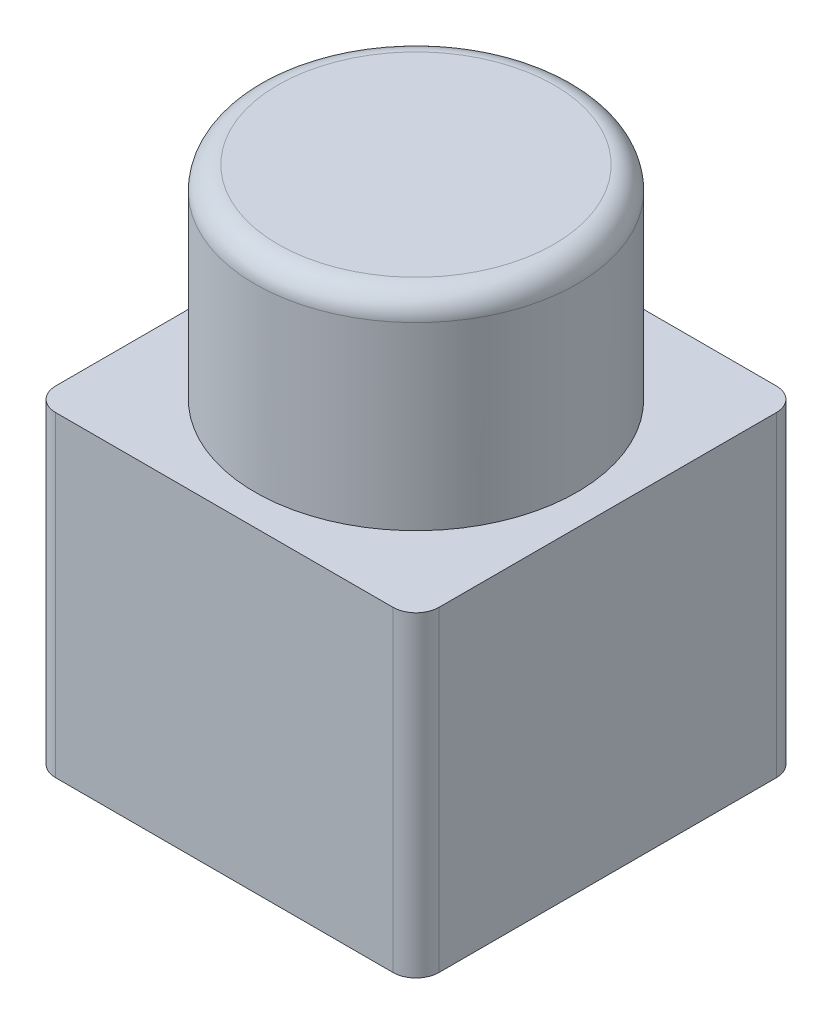
ISO-10303-21;
HEADER;
FILE_DESCRIPTION(('STEP AP214'),'2;1');
FILE_NAME('part.step','',(''),(''),'','','');
FILE_SCHEMA(('AUTOMOTIVE_DESIGN { 1 0 10303 214 1 1 1 1 }'));
ENDSEC;
DATA;
#1=APPLICATION_CONTEXT('core data for automotive mechanical design processes');
#2=APPLICATION_PROTOCOL_DEFINITION('international standard','automotive_design',2000,#1);
#3=PRODUCT_CONTEXT('',#1,'mechanical');
#4=PRODUCT('Part','Part','',(#3));
#5=PRODUCT_RELATED_PRODUCT_CATEGORY('part','',(#4));
#6=PRODUCT_DEFINITION_FORMATION('','',#4);
#7=PRODUCT_DEFINITION_CONTEXT('part definition',#1,'design');
#8=PRODUCT_DEFINITION('design','',#6,#7);
#9=PRODUCT_DEFINITION_SHAPE('','',#8);
#10=(LENGTH_UNIT() NAMED_UNIT(*) SI_UNIT(.MILLI.,.METRE.));
#11=(NAMED_UNIT(*) PLANE_ANGLE_UNIT() SI_UNIT($,.RADIAN.));
#12=(NAMED_UNIT(*) SI_UNIT($,.STERADIAN.) SOLID_ANGLE_UNIT());
#13=UNCERTAINTY_MEASURE_WITH_UNIT(LENGTH_MEASURE(1.E-05),#10,'distance_accuracy_value','');
#14=(GEOMETRIC_REPRESENTATION_CONTEXT(3) GLOBAL_UNCERTAINTY_ASSIGNED_CONTEXT((#13)) GLOBAL_UNIT_ASSIGNED_CONTEXT((#10,
#11,#12)) REPRESENTATION_CONTEXT('',''));
#15=CARTESIAN_POINT('',(0.,0.,0.));
#16=DIRECTION('',(0.,0.,1.));
#17=DIRECTION('',(1.,0.,0.));
#18=AXIS2_PLACEMENT_3D('',#15,#16,#17);
#19=CARTESIAN_POINT('',(0.,41.25,0.));
#20=DIRECTION('',(-1.,0.,0.));
#21=DIRECTION('',(0.,0.,1.));
#22=AXIS2_PLACEMENT_3D('',#19,#20,#21);
#23=PLANE('',#22);
#24=DIRECTION('',(0.,0.,-1.));
#25=VECTOR('',#24,1.);
#26=CARTESIAN_POINT('',(0.,41.25,0.));
#27=LINE('',#26,#25);
#28=CARTESIAN_POINT('',(0.,41.25,-3.));
#29=VERTEX_POINT('',#28);
#30=CARTESIAN_POINT('',(0.,41.25,-47.));
#31=VERTEX_POINT('',#30);
#32=EDGE_CURVE('E158',#29,#31,#27,.T.);
#33=ORIENTED_EDGE('',*,*,#32,.T.);
#34=DIRECTION('',(0.,-1.,0.));
#35=VECTOR('',#34,1.);
#36=CARTESIAN_POINT('',(0.,41.25,-47.));
#37=LINE('',#36,#35);
#38=CARTESIAN_POINT('',(0.,0.,-47.));
#39=VERTEX_POINT('',#38);
#40=EDGE_CURVE('E149',#31,#39,#37,.T.);
#41=ORIENTED_EDGE('',*,*,#40,.T.);
#42=DIRECTION('',(0.,0.,-1.));
#43=VECTOR('',#42,1.);
#44=CARTESIAN_POINT('',(0.,0.,0.));
#45=LINE('',#44,#43);
#46=CARTESIAN_POINT('',(0.,0.,-3.));
#47=VERTEX_POINT('',#46);
#48=EDGE_CURVE('E103',#47,#39,#45,.T.);
#49=ORIENTED_EDGE('',*,*,#48,.F.);
#50=DIRECTION('',(0.,-1.,0.));
#51=VECTOR('',#50,1.);
#52=CARTESIAN_POINT('',(0.,41.25,-3.));
#53=LINE('',#52,#51);
#54=EDGE_CURVE('E147',#47,#29,#53,.F.);
#55=ORIENTED_EDGE('',*,*,#54,.T.);
#56=EDGE_LOOP('',(#33,#41,#49,#55));
#57=FACE_BOUND('',#56,.T.);
#58=ADVANCED_FACE('F33',(#57),#23,.T.);
#59=CARTESIAN_POINT('',(0.,41.25,0.));
#60=DIRECTION('',(0.,0.,-1.));
#61=DIRECTION('',(-1.,0.,0.));
#62=AXIS2_PLACEMENT_3D('',#59,#60,#61);
#63=PLANE('',#62);
#64=DIRECTION('',(1.,0.,0.));
#65=VECTOR('',#64,1.);
#66=CARTESIAN_POINT('',(0.,0.,0.));
#67=LINE('',#66,#65);
#68=CARTESIAN_POINT('',(3.,0.,0.));
#69=VERTEX_POINT('',#68);
#70=CARTESIAN_POINT('',(47.,0.,0.));
#71=VERTEX_POINT('',#70);
#72=EDGE_CURVE('E154',#69,#71,#67,.T.);
#73=ORIENTED_EDGE('',*,*,#72,.T.);
#74=DIRECTION('',(0.,-1.,0.));
#75=VECTOR('',#74,1.);
#76=CARTESIAN_POINT('',(47.,41.25,0.));
#77=LINE('',#76,#75);
#78=CARTESIAN_POINT('',(47.,41.25,0.));
#79=VERTEX_POINT('',#78);
#80=EDGE_CURVE('E11',#71,#79,#77,.F.);
#81=ORIENTED_EDGE('',*,*,#80,.T.);
#82=DIRECTION('',(1.,0.,0.));
#83=VECTOR('',#82,1.);
#84=CARTESIAN_POINT('',(0.,41.25,0.));
#85=LINE('',#84,#83);
#86=CARTESIAN_POINT('',(3.,41.25,0.));
#87=VERTEX_POINT('',#86);
#88=EDGE_CURVE('E155',#87,#79,#85,.T.);
#89=ORIENTED_EDGE('',*,*,#88,.F.);
#90=DIRECTION('',(0.,-1.,0.));
#91=VECTOR('',#90,1.);
#92=CARTESIAN_POINT('',(3.,0.,0.));
#93=LINE('',#92,#91);
#94=EDGE_CURVE('E41',#87,#69,#93,.T.);
#95=ORIENTED_EDGE('',*,*,#94,.T.);
#96=EDGE_LOOP('',(#73,#81,#89,#95));
#97=FACE_BOUND('',#96,.T.);
#98=ADVANCED_FACE('F153',(#97),#63,.F.);
#99=CARTESIAN_POINT('',(50.,41.25,0.));
#100=DIRECTION('',(-1.,0.,0.));
#101=DIRECTION('',(0.,0.,1.));
#102=AXIS2_PLACEMENT_3D('',#99,#100,#101);
#103=PLANE('',#102);
#104=DIRECTION('',(0.,0.,-1.));
#105=VECTOR('',#104,1.);
#106=CARTESIAN_POINT('',(50.,0.,0.));
#107=LINE('',#106,#105);
#108=CARTESIAN_POINT('',(50.,0.,-3.));
#109=VERTEX_POINT('',#108);
#110=CARTESIAN_POINT('',(50.,0.,-47.));
#111=VERTEX_POINT('',#110);
#112=EDGE_CURVE('E119',#109,#111,#107,.T.);
#113=ORIENTED_EDGE('',*,*,#112,.T.);
#114=DIRECTION('',(0.,-1.,0.));
#115=VECTOR('',#114,1.);
#116=CARTESIAN_POINT('',(50.,41.25,-47.));
#117=LINE('',#116,#115);
#118=CARTESIAN_POINT('',(50.,41.25,-47.));
#119=VERTEX_POINT('',#118);
#120=EDGE_CURVE('E139',#111,#119,#117,.F.);
#121=ORIENTED_EDGE('',*,*,#120,.T.);
#122=DIRECTION('',(0.,0.,-1.));
#123=VECTOR('',#122,1.);
#124=CARTESIAN_POINT('',(50.,41.25,0.));
#125=LINE('',#124,#123);
#126=CARTESIAN_POINT('',(50.,41.25,-3.));
#127=VERTEX_POINT('',#126);
#128=EDGE_CURVE('E232',#127,#119,#125,.T.);
#129=ORIENTED_EDGE('',*,*,#128,.F.);
#130=DIRECTION('',(0.,-1.,0.));
#131=VECTOR('',#130,1.);
#132=CARTESIAN_POINT('',(50.,41.25,-3.));
#133=LINE('',#132,#131);
#134=EDGE_CURVE('E136',#127,#109,#133,.T.);
#135=ORIENTED_EDGE('',*,*,#134,.T.);
#136=EDGE_LOOP('',(#113,#121,#129,#135));
#137=FACE_BOUND('',#136,.T.);
#138=ADVANCED_FACE('F193',(#137),#103,.F.);
#139=CARTESIAN_POINT('',(0.,41.25,-50.));
#140=DIRECTION('',(0.,0.,-1.));
#141=DIRECTION('',(-1.,0.,0.));
#142=AXIS2_PLACEMENT_3D('',#139,#140,#141);
#143=PLANE('',#142);
#144=DIRECTION('',(1.,0.,0.));
#145=VECTOR('',#144,1.);
#146=CARTESIAN_POINT('',(0.,41.25,-50.));
#147=LINE('',#146,#145);
#148=CARTESIAN_POINT('',(3.,41.25,-50.));
#149=VERTEX_POINT('',#148);
#150=CARTESIAN_POINT('',(47.,41.25,-50.));
#151=VERTEX_POINT('',#150);
#152=EDGE_CURVE('E161',#149,#151,#147,.T.);
#153=ORIENTED_EDGE('',*,*,#152,.T.);
#154=DIRECTION('',(0.,-1.,0.));
#155=VECTOR('',#154,1.);
#156=CARTESIAN_POINT('',(47.,0.,-50.));
#157=LINE('',#156,#155);
#158=CARTESIAN_POINT('',(47.,0.,-50.));
#159=VERTEX_POINT('',#158);
#160=EDGE_CURVE('E118',#151,#159,#157,.T.);
#161=ORIENTED_EDGE('',*,*,#160,.T.);
#162=DIRECTION('',(1.,0.,0.));
#163=VECTOR('',#162,1.);
#164=CARTESIAN_POINT('',(0.,0.,-50.));
#165=LINE('',#164,#163);
#166=CARTESIAN_POINT('',(3.,0.,-50.));
#167=VERTEX_POINT('',#166);
#168=EDGE_CURVE('E101',#167,#159,#165,.T.);
#169=ORIENTED_EDGE('',*,*,#168,.F.);
#170=DIRECTION('',(0.,-1.,0.));
#171=VECTOR('',#170,1.);
#172=CARTESIAN_POINT('',(3.,41.25,-50.));
#173=LINE('',#172,#171);
#174=EDGE_CURVE('E115',#167,#149,#173,.F.);
#175=ORIENTED_EDGE('',*,*,#174,.T.);
#176=EDGE_LOOP('',(#153,#161,#169,#175));
#177=FACE_BOUND('',#176,.T.);
#178=ADVANCED_FACE('F114',(#177),#143,.T.);
#179=CARTESIAN_POINT('',(0.,41.25,0.));
#180=DIRECTION('',(0.,-1.,0.));
#181=DIRECTION('',(0.,0.,-1.));
#182=AXIS2_PLACEMENT_3D('',#179,#180,#181);
#183=PLANE('',#182);
#184=CARTESIAN_POINT('',(25.,41.25,-25.));
#185=DIRECTION('',(0.,-1.,0.));
#186=DIRECTION('',(0.,0.,-1.));
#187=AXIS2_PLACEMENT_3D('',#184,#185,#186);
#188=CIRCLE('',#187,21.);
#189=CARTESIAN_POINT('',(25.,41.25,-46.));
#190=VERTEX_POINT('',#189);
#191=EDGE_CURVE('E166',#190,#190,#188,.F.);
#192=ORIENTED_EDGE('',*,*,#191,.F.);
#193=EDGE_LOOP('',(#192));
#194=FACE_BOUND('',#193,.T.);
#195=ORIENTED_EDGE('',*,*,#128,.T.);
#196=CARTESIAN_POINT('',(47.,41.25,-47.));
#197=DIRECTION('',(0.,-1.,0.));
#198=DIRECTION('',(0.,0.,-1.));
#199=AXIS2_PLACEMENT_3D('',#196,#197,#198);
#200=CIRCLE('',#199,3.);
#201=EDGE_CURVE('E145',#119,#151,#200,.F.);
#202=ORIENTED_EDGE('',*,*,#201,.T.);
#203=ORIENTED_EDGE('',*,*,#152,.F.);
#204=CARTESIAN_POINT('',(3.,41.25,-47.));
#205=DIRECTION('',(0.,-1.,0.));
#206=DIRECTION('',(0.,0.,-1.));
#207=AXIS2_PLACEMENT_3D('',#204,#205,#206);
#208=CIRCLE('',#207,3.);
#209=EDGE_CURVE('E123',#149,#31,#208,.F.);
#210=ORIENTED_EDGE('',*,*,#209,.T.);
#211=ORIENTED_EDGE('',*,*,#32,.F.);
#212=CARTESIAN_POINT('',(3.,41.25,-3.));
#213=DIRECTION('',(0.,-1.,0.));
#214=DIRECTION('',(0.,0.,-1.));
#215=AXIS2_PLACEMENT_3D('',#212,#213,#214);
#216=CIRCLE('',#215,3.);
#217=EDGE_CURVE('E53',#29,#87,#216,.F.);
#218=ORIENTED_EDGE('',*,*,#217,.T.);
#219=ORIENTED_EDGE('',*,*,#88,.T.);
#220=CARTESIAN_POINT('',(47.,41.25,-3.));
#221=DIRECTION('',(0.,-1.,0.));
#222=DIRECTION('',(0.,0.,-1.));
#223=AXIS2_PLACEMENT_3D('',#220,#221,#222);
#224=CIRCLE('',#223,3.);
#225=EDGE_CURVE('E142',#79,#127,#224,.F.);
#226=ORIENTED_EDGE('',*,*,#225,.T.);
#227=EDGE_LOOP('',(#195,#202,#203,#210,#211,#218,#219,#226));
#228=FACE_BOUND('',#227,.T.);
#229=ADVANCED_FACE('F198',(#194,#228),#183,.F.);
#230=CARTESIAN_POINT('',(0.,0.,0.));
#231=DIRECTION('',(0.,-1.,0.));
#232=DIRECTION('',(0.,0.,-1.));
#233=AXIS2_PLACEMENT_3D('',#230,#231,#232);
#234=PLANE('',#233);
#235=CARTESIAN_POINT('',(5.00000000000001,0.,-4.99999999500002));
#236=DIRECTION('',(0.,-1.,0.));
#237=DIRECTION('',(0.,0.,-1.));
#238=AXIS2_PLACEMENT_3D('',#235,#236,#237);
#239=CIRCLE('',#238,1.5);
#240=CARTESIAN_POINT('',(5.00000000000001,0.,-6.49999999500001));
#241=VERTEX_POINT('',#240);
#242=EDGE_CURVE('E351',#241,#241,#239,.T.);
#243=ORIENTED_EDGE('',*,*,#242,.F.);
#244=EDGE_LOOP('',(#243));
#245=FACE_BOUND('',#244,.T.);
#246=CARTESIAN_POINT('',(45.,0.,-45.000000005));
#247=DIRECTION('',(0.,-1.,0.));
#248=DIRECTION('',(0.,0.,-1.));
#249=AXIS2_PLACEMENT_3D('',#246,#247,#248);
#250=CIRCLE('',#249,1.5);
#251=CARTESIAN_POINT('',(45.,0.,-46.500000005));
#252=VERTEX_POINT('',#251);
#253=EDGE_CURVE('E347',#252,#252,#250,.T.);
#254=ORIENTED_EDGE('',*,*,#253,.F.);
#255=EDGE_LOOP('',(#254));
#256=FACE_BOUND('',#255,.T.);
#257=ORIENTED_EDGE('',*,*,#168,.T.);
#258=CARTESIAN_POINT('',(47.,0.,-47.));
#259=DIRECTION('',(0.,-1.,0.));
#260=DIRECTION('',(0.,0.,-1.));
#261=AXIS2_PLACEMENT_3D('',#258,#259,#260);
#262=CIRCLE('',#261,3.);
#263=EDGE_CURVE('E108',#159,#111,#262,.T.);
#264=ORIENTED_EDGE('',*,*,#263,.T.);
#265=ORIENTED_EDGE('',*,*,#112,.F.);
#266=CARTESIAN_POINT('',(47.,0.,-3.));
#267=DIRECTION('',(0.,-1.,0.));
#268=DIRECTION('',(0.,0.,-1.));
#269=AXIS2_PLACEMENT_3D('',#266,#267,#268);
#270=CIRCLE('',#269,3.);
#271=EDGE_CURVE('E109',#109,#71,#270,.T.);
#272=ORIENTED_EDGE('',*,*,#271,.T.);
#273=ORIENTED_EDGE('',*,*,#72,.F.);
#274=CARTESIAN_POINT('',(3.,0.,-3.));
#275=DIRECTION('',(0.,-1.,0.));
#276=DIRECTION('',(0.,0.,-1.));
#277=AXIS2_PLACEMENT_3D('',#274,#275,#276);
#278=CIRCLE('',#277,3.);
#279=EDGE_CURVE('E126',#69,#47,#278,.T.);
#280=ORIENTED_EDGE('',*,*,#279,.T.);
#281=ORIENTED_EDGE('',*,*,#48,.T.);
#282=CARTESIAN_POINT('',(3.,0.,-47.));
#283=DIRECTION('',(0.,-1.,0.));
#284=DIRECTION('',(0.,0.,-1.));
#285=AXIS2_PLACEMENT_3D('',#282,#283,#284);
#286=CIRCLE('',#285,3.);
#287=EDGE_CURVE('E98',#39,#167,#286,.T.);
#288=ORIENTED_EDGE('',*,*,#287,.T.);
#289=EDGE_LOOP('',(#257,#264,#265,#272,#273,#280,#281,#288));
#290=FACE_BOUND('',#289,.T.);
#291=ADVANCED_FACE('F100',(#245,#256,#290),#234,.T.);
#292=CARTESIAN_POINT('',(45.,6.,-45.000000005));
#293=DIRECTION('',(0.,-1.,0.));
#294=DIRECTION('',(0.,0.,-1.));
#295=AXIS2_PLACEMENT_3D('',#292,#293,#294);
#296=CYLINDRICAL_SURFACE('',#295,1.5);
#297=CARTESIAN_POINT('',(45.,6.,-45.000000005));
#298=DIRECTION('',(0.,-1.,0.));
#299=DIRECTION('',(0.,0.,-1.));
#300=AXIS2_PLACEMENT_3D('',#297,#298,#299);
#301=CIRCLE('',#300,1.5);
#302=CARTESIAN_POINT('',(45.,6.,-46.500000005));
#303=VERTEX_POINT('',#302);
#304=EDGE_CURVE('E345',#303,#303,#301,.T.);
#305=ORIENTED_EDGE('',*,*,#304,.F.);
#306=EDGE_LOOP('',(#305));
#307=FACE_BOUND('',#306,.T.);
#308=ORIENTED_EDGE('',*,*,#253,.T.);
#309=EDGE_LOOP('',(#308));
#310=FACE_BOUND('',#309,.T.);
#311=ADVANCED_FACE('F204',(#307,#310),#296,.F.);
#312=CARTESIAN_POINT('',(45.,6.,-45.000000005));
#313=DIRECTION('',(0.,-1.,0.));
#314=DIRECTION('',(0.,0.,-1.));
#315=AXIS2_PLACEMENT_3D('',#312,#313,#314);
#316=PLANE('',#315);
#317=ORIENTED_EDGE('',*,*,#304,.T.);
#318=EDGE_LOOP('',(#317));
#319=FACE_BOUND('',#318,.T.);
#320=ADVANCED_FACE('F211',(#319),#316,.T.);
#321=CARTESIAN_POINT('',(5.00000000000001,6.,-4.99999999500002));
#322=DIRECTION('',(0.,-1.,0.));
#323=DIRECTION('',(0.,0.,-1.));
#324=AXIS2_PLACEMENT_3D('',#321,#322,#323);
#325=CYLINDRICAL_SURFACE('',#324,1.5);
#326=CARTESIAN_POINT('',(5.00000000000001,6.,-4.99999999500002));
#327=DIRECTION('',(0.,-1.,0.));
#328=DIRECTION('',(0.,0.,-1.));
#329=AXIS2_PLACEMENT_3D('',#326,#327,#328);
#330=CIRCLE('',#329,1.5);
#331=CARTESIAN_POINT('',(5.00000000000001,6.,-6.49999999500001));
#332=VERTEX_POINT('',#331);
#333=EDGE_CURVE('E353',#332,#332,#330,.T.);
#334=ORIENTED_EDGE('',*,*,#333,.F.);
#335=EDGE_LOOP('',(#334));
#336=FACE_BOUND('',#335,.T.);
#337=ORIENTED_EDGE('',*,*,#242,.T.);
#338=EDGE_LOOP('',(#337));
#339=FACE_BOUND('',#338,.T.);
#340=ADVANCED_FACE('F215',(#336,#339),#325,.F.);
#341=CARTESIAN_POINT('',(5.00000000000001,6.,-4.99999999500002));
#342=DIRECTION('',(0.,-1.,0.));
#343=DIRECTION('',(0.,0.,-1.));
#344=AXIS2_PLACEMENT_3D('',#341,#342,#343);
#345=PLANE('',#344);
#346=ORIENTED_EDGE('',*,*,#333,.T.);
#347=EDGE_LOOP('',(#346));
#348=FACE_BOUND('',#347,.T.);
#349=ADVANCED_FACE('F217',(#348),#345,.T.);
#350=CARTESIAN_POINT('',(25.,67.75,-25.));
#351=DIRECTION('',(0.,-1.,0.));
#352=DIRECTION('',(0.,0.,-1.));
#353=AXIS2_PLACEMENT_3D('',#350,#351,#352);
#354=CYLINDRICAL_SURFACE('',#353,21.);
#355=CARTESIAN_POINT('',(25.,64.75,-25.));
#356=DIRECTION('',(0.,1.,0.));
#357=DIRECTION('',(0.,0.,1.));
#358=AXIS2_PLACEMENT_3D('',#355,#356,#357);
#359=CIRCLE('',#358,21.);
#360=CARTESIAN_POINT('',(25.,64.75,-4.));
#361=VERTEX_POINT('',#360);
#362=EDGE_CURVE('E124',#361,#361,#359,.F.);
#363=ORIENTED_EDGE('',*,*,#362,.T.);
#364=EDGE_LOOP('',(#363));
#365=FACE_BOUND('',#364,.T.);
#366=ORIENTED_EDGE('',*,*,#191,.T.);
#367=EDGE_LOOP('',(#366));
#368=FACE_BOUND('',#367,.T.);
#369=ADVANCED_FACE('F184',(#365,#368),#354,.T.);
#370=CARTESIAN_POINT('',(25.,67.75,-25.));
#371=DIRECTION('',(0.,1.,0.));
#372=DIRECTION('',(0.,0.,1.));
#373=AXIS2_PLACEMENT_3D('',#370,#371,#372);
#374=PLANE('',#373);
#375=CARTESIAN_POINT('',(25.,67.75,-25.));
#376=DIRECTION('',(0.,1.,0.));
#377=DIRECTION('',(0.,0.,1.));
#378=AXIS2_PLACEMENT_3D('',#375,#376,#377);
#379=CIRCLE('',#378,18.);
#380=CARTESIAN_POINT('',(25.,67.75,-7.));
#381=VERTEX_POINT('',#380);
#382=EDGE_CURVE('E129',#381,#381,#379,.T.);
#383=ORIENTED_EDGE('',*,*,#382,.T.);
#384=EDGE_LOOP('',(#383));
#385=FACE_BOUND('',#384,.T.);
#386=ADVANCED_FACE('F171',(#385),#374,.T.);
#387=CARTESIAN_POINT('',(25.,64.75,-25.));
#388=DIRECTION('',(0.,1.,0.));
#389=DIRECTION('',(0.,0.,1.));
#390=AXIS2_PLACEMENT_3D('',#387,#388,#389);
#391=TOROIDAL_SURFACE('',#390,18.,3.);
#392=ORIENTED_EDGE('',*,*,#362,.F.);
#393=EDGE_LOOP('',(#392));
#394=FACE_BOUND('',#393,.T.);
#395=ORIENTED_EDGE('',*,*,#382,.F.);
#396=EDGE_LOOP('',(#395));
#397=FACE_BOUND('',#396,.T.);
#398=ADVANCED_FACE('F173',(#394,#397),#391,.T.);
#399=CARTESIAN_POINT('',(47.,41.25,-47.));
#400=DIRECTION('',(0.,1.,0.));
#401=DIRECTION('',(0.,0.,1.));
#402=AXIS2_PLACEMENT_3D('',#399,#400,#401);
#403=CYLINDRICAL_SURFACE('',#402,3.);
#404=ORIENTED_EDGE('',*,*,#201,.F.);
#405=ORIENTED_EDGE('',*,*,#120,.F.);
#406=ORIENTED_EDGE('',*,*,#263,.F.);
#407=ORIENTED_EDGE('',*,*,#160,.F.);
#408=EDGE_LOOP('',(#404,#405,#406,#407));
#409=FACE_BOUND('',#408,.T.);
#410=ADVANCED_FACE('F175',(#409),#403,.T.);
#411=CARTESIAN_POINT('',(3.,41.25,-47.));
#412=DIRECTION('',(0.,-1.,0.));
#413=DIRECTION('',(0.,0.,-1.));
#414=AXIS2_PLACEMENT_3D('',#411,#412,#413);
#415=CYLINDRICAL_SURFACE('',#414,3.);
#416=ORIENTED_EDGE('',*,*,#209,.F.);
#417=ORIENTED_EDGE('',*,*,#174,.F.);
#418=ORIENTED_EDGE('',*,*,#287,.F.);
#419=ORIENTED_EDGE('',*,*,#40,.F.);
#420=EDGE_LOOP('',(#416,#417,#418,#419));
#421=FACE_BOUND('',#420,.T.);
#422=ADVANCED_FACE('F122',(#421),#415,.T.);
#423=CARTESIAN_POINT('',(47.,41.25,-3.));
#424=DIRECTION('',(0.,-1.,0.));
#425=DIRECTION('',(0.,0.,-1.));
#426=AXIS2_PLACEMENT_3D('',#423,#424,#425);
#427=CYLINDRICAL_SURFACE('',#426,3.);
#428=ORIENTED_EDGE('',*,*,#225,.F.);
#429=ORIENTED_EDGE('',*,*,#80,.F.);
#430=ORIENTED_EDGE('',*,*,#271,.F.);
#431=ORIENTED_EDGE('',*,*,#134,.F.);
#432=EDGE_LOOP('',(#428,#429,#430,#431));
#433=FACE_BOUND('',#432,.T.);
#434=ADVANCED_FACE('F239',(#433),#427,.T.);
#435=CARTESIAN_POINT('',(3.,41.25,-3.));
#436=DIRECTION('',(0.,1.,0.));
#437=DIRECTION('',(0.,0.,1.));
#438=AXIS2_PLACEMENT_3D('',#435,#436,#437);
#439=CYLINDRICAL_SURFACE('',#438,3.);
#440=ORIENTED_EDGE('',*,*,#217,.F.);
#441=ORIENTED_EDGE('',*,*,#54,.F.);
#442=ORIENTED_EDGE('',*,*,#279,.F.);
#443=ORIENTED_EDGE('',*,*,#94,.F.);
#444=EDGE_LOOP('',(#440,#441,#442,#443));
#445=FACE_BOUND('',#444,.T.);
#446=ADVANCED_FACE('F35',(#445),#439,.T.);
#447=CLOSED_SHELL('',(#58,#98,#138,#178,#229,#291,#311,#320,#340,#349,#369,#386,#398,#410,#422,
#434,#446));
#448=MANIFOLD_SOLID_BREP('B2',#447);
#449=ADVANCED_BREP_SHAPE_REPRESENTATION('',(#18,#448),#14);
#450=SHAPE_DEFINITION_REPRESENTATION(#9,#449);
ENDSEC;
END-ISO-10303-21;
